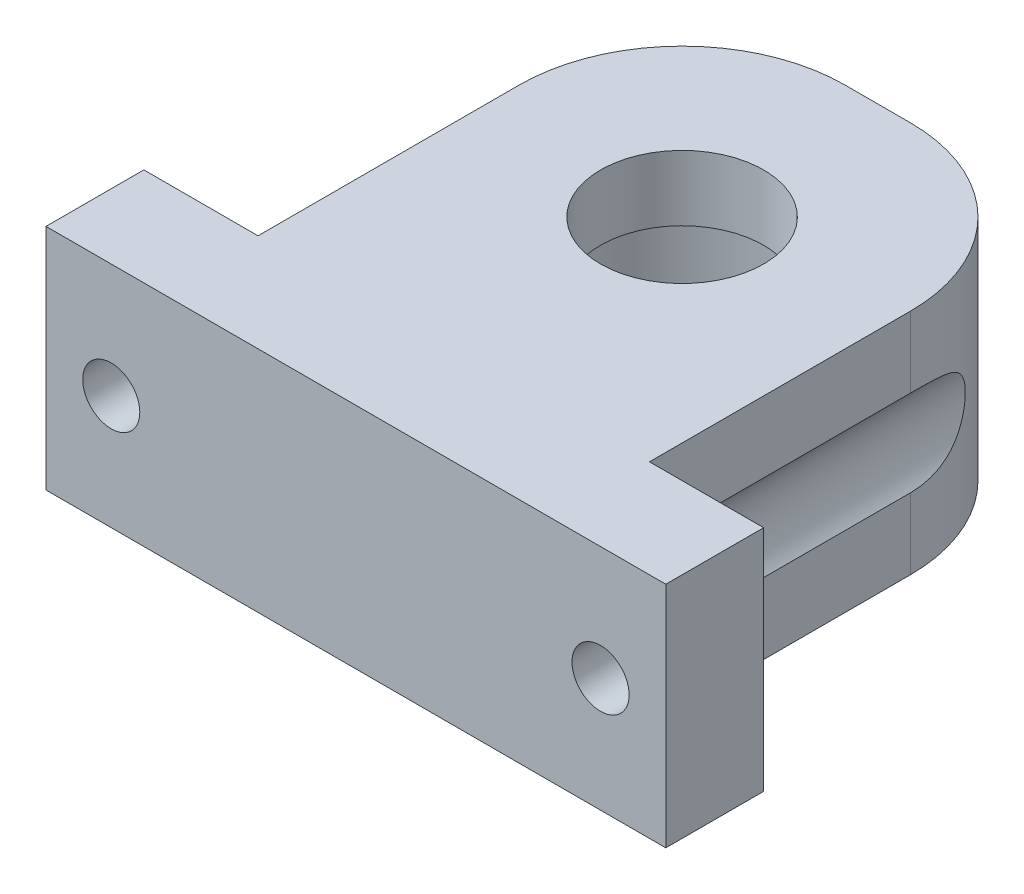
ISO-10303-21;
HEADER;
FILE_DESCRIPTION(('STEP AP214'),'2;1');
FILE_NAME('part.step','',(''),(''),'','','');
FILE_SCHEMA(('AUTOMOTIVE_DESIGN { 1 0 10303 214 1 1 1 1 }'));
ENDSEC;
DATA;
#1=APPLICATION_CONTEXT('core data for automotive mechanical design processes');
#2=APPLICATION_PROTOCOL_DEFINITION('international standard','automotive_design',2000,#1);
#3=PRODUCT_CONTEXT('',#1,'mechanical');
#4=PRODUCT('Part','Part','',(#3));
#5=PRODUCT_RELATED_PRODUCT_CATEGORY('part','',(#4));
#6=PRODUCT_DEFINITION_FORMATION('','',#4);
#7=PRODUCT_DEFINITION_CONTEXT('part definition',#1,'design');
#8=PRODUCT_DEFINITION('design','',#6,#7);
#9=PRODUCT_DEFINITION_SHAPE('','',#8);
#10=(LENGTH_UNIT() NAMED_UNIT(*) SI_UNIT(.MILLI.,.METRE.));
#11=(NAMED_UNIT(*) PLANE_ANGLE_UNIT() SI_UNIT($,.RADIAN.));
#12=(NAMED_UNIT(*) SI_UNIT($,.STERADIAN.) SOLID_ANGLE_UNIT());
#13=UNCERTAINTY_MEASURE_WITH_UNIT(LENGTH_MEASURE(1.E-05),#10,'distance_accuracy_value','');
#14=(GEOMETRIC_REPRESENTATION_CONTEXT(3) GLOBAL_UNCERTAINTY_ASSIGNED_CONTEXT((#13)) GLOBAL_UNIT_ASSIGNED_CONTEXT((#10,
#11,#12)) REPRESENTATION_CONTEXT('',''));
#15=CARTESIAN_POINT('',(0.,0.,0.));
#16=DIRECTION('',(0.,0.,1.));
#17=DIRECTION('',(1.,0.,0.));
#18=AXIS2_PLACEMENT_3D('',#15,#16,#17);
#19=CARTESIAN_POINT('',(12.,-7.,0.));
#20=DIRECTION('',(-1.,0.,0.));
#21=DIRECTION('',(0.,0.,1.));
#22=AXIS2_PLACEMENT_3D('',#19,#20,#21);
#23=PLANE('',#22);
#24=DIRECTION('',(0.,0.,1.));
#25=VECTOR('',#24,1.);
#26=CARTESIAN_POINT('',(12.,-2.64575131106457,-32.001));
#27=LINE('',#26,#25);
#28=CARTESIAN_POINT('',(12.,-2.64575131106456,-22.));
#29=VERTEX_POINT('',#28);
#30=CARTESIAN_POINT('',(12.,-2.64575131106456,-6.00000000000001));
#31=VERTEX_POINT('',#30);
#32=EDGE_CURVE('E57',#29,#31,#27,.T.);
#33=ORIENTED_EDGE('',*,*,#32,.T.);
#34=DIRECTION('',(0.,1.,0.));
#35=VECTOR('',#34,1.);
#36=CARTESIAN_POINT('',(12.,-7.,-6.00000000000001));
#37=LINE('',#36,#35);
#38=CARTESIAN_POINT('',(12.,-7.,-6.00000000000001));
#39=VERTEX_POINT('',#38);
#40=EDGE_CURVE('E169',#39,#31,#37,.T.);
#41=ORIENTED_EDGE('',*,*,#40,.F.);
#42=DIRECTION('',(0.,0.,1.));
#43=VECTOR('',#42,1.);
#44=CARTESIAN_POINT('',(12.,-7.,0.));
#45=LINE('',#44,#43);
#46=CARTESIAN_POINT('',(12.,-7.,-22.));
#47=VERTEX_POINT('',#46);
#48=EDGE_CURVE('E235',#47,#39,#45,.T.);
#49=ORIENTED_EDGE('',*,*,#48,.F.);
#50=DIRECTION('',(0.,1.,0.));
#51=VECTOR('',#50,1.);
#52=CARTESIAN_POINT('',(12.,-7.,-22.));
#53=LINE('',#52,#51);
#54=EDGE_CURVE('E42',#47,#29,#53,.T.);
#55=ORIENTED_EDGE('',*,*,#54,.T.);
#56=EDGE_LOOP('',(#33,#41,#49,#55));
#57=FACE_BOUND('',#56,.T.);
#58=ADVANCED_FACE('F34',(#57),#23,.F.);
#59=DIRECTION('',(0.,0.,1.));
#60=VECTOR('',#59,1.);
#61=CARTESIAN_POINT('',(12.,2.64575131106457,-32.001));
#62=LINE('',#61,#60);
#63=CARTESIAN_POINT('',(12.,2.64575131106456,-6.00000000000001));
#64=VERTEX_POINT('',#63);
#65=CARTESIAN_POINT('',(12.,2.64575131106456,-22.));
#66=VERTEX_POINT('',#65);
#67=EDGE_CURVE('E197',#64,#66,#62,.F.);
#68=ORIENTED_EDGE('',*,*,#67,.T.);
#69=CARTESIAN_POINT('',(12.,7.,-22.));
#70=VERTEX_POINT('',#69);
#71=EDGE_CURVE('E181',#66,#70,#53,.T.);
#72=ORIENTED_EDGE('',*,*,#71,.T.);
#73=DIRECTION('',(0.,0.,1.));
#74=VECTOR('',#73,1.);
#75=CARTESIAN_POINT('',(12.,7.,0.));
#76=LINE('',#75,#74);
#77=CARTESIAN_POINT('',(12.,7.,-6.00000000000001));
#78=VERTEX_POINT('',#77);
#79=EDGE_CURVE('E194',#70,#78,#76,.T.);
#80=ORIENTED_EDGE('',*,*,#79,.T.);
#81=EDGE_CURVE('E254',#64,#78,#37,.T.);
#82=ORIENTED_EDGE('',*,*,#81,.F.);
#83=EDGE_LOOP('',(#68,#72,#80,#82));
#84=FACE_BOUND('',#83,.T.);
#85=ADVANCED_FACE('F191',(#84),#23,.F.);
#86=CARTESIAN_POINT('',(-12.,-7.,0.));
#87=DIRECTION('',(-1.,0.,0.));
#88=DIRECTION('',(0.,0.,1.));
#89=AXIS2_PLACEMENT_3D('',#86,#87,#88);
#90=PLANE('',#89);
#91=DIRECTION('',(0.,1.,0.));
#92=VECTOR('',#91,1.);
#93=CARTESIAN_POINT('',(-12.,-7.,-6.));
#94=LINE('',#93,#92);
#95=CARTESIAN_POINT('',(-12.,-7.,-6.));
#96=VERTEX_POINT('',#95);
#97=CARTESIAN_POINT('',(-12.,-2.64575131106459,-6.));
#98=VERTEX_POINT('',#97);
#99=EDGE_CURVE('E157',#96,#98,#94,.T.);
#100=ORIENTED_EDGE('',*,*,#99,.T.);
#101=DIRECTION('',(0.,0.,1.));
#102=VECTOR('',#101,1.);
#103=CARTESIAN_POINT('',(-12.,-2.64575131106458,-32.001));
#104=LINE('',#103,#102);
#105=CARTESIAN_POINT('',(-12.,-2.64575131106458,-22.));
#106=VERTEX_POINT('',#105);
#107=EDGE_CURVE('E136',#106,#98,#104,.T.);
#108=ORIENTED_EDGE('',*,*,#107,.F.);
#109=DIRECTION('',(0.,1.,0.));
#110=VECTOR('',#109,1.);
#111=CARTESIAN_POINT('',(-12.,-7.,-22.));
#112=LINE('',#111,#110);
#113=CARTESIAN_POINT('',(-12.,-7.,-22.));
#114=VERTEX_POINT('',#113);
#115=EDGE_CURVE('E176',#106,#114,#112,.F.);
#116=ORIENTED_EDGE('',*,*,#115,.T.);
#117=DIRECTION('',(0.,0.,1.));
#118=VECTOR('',#117,1.);
#119=CARTESIAN_POINT('',(-12.,-7.,0.));
#120=LINE('',#119,#118);
#121=EDGE_CURVE('E240',#114,#96,#120,.T.);
#122=ORIENTED_EDGE('',*,*,#121,.T.);
#123=EDGE_LOOP('',(#100,#108,#116,#122));
#124=FACE_BOUND('',#123,.T.);
#125=ADVANCED_FACE('F284',(#124),#90,.T.);
#126=CARTESIAN_POINT('',(-12.,7.,-22.));
#127=VERTEX_POINT('',#126);
#128=CARTESIAN_POINT('',(-12.,2.64575131106458,-22.));
#129=VERTEX_POINT('',#128);
#130=EDGE_CURVE('E150',#127,#129,#112,.F.);
#131=ORIENTED_EDGE('',*,*,#130,.T.);
#132=DIRECTION('',(0.,0.,1.));
#133=VECTOR('',#132,1.);
#134=CARTESIAN_POINT('',(-12.,2.64575131106458,-32.001));
#135=LINE('',#134,#133);
#136=CARTESIAN_POINT('',(-12.,2.64575131106459,-6.));
#137=VERTEX_POINT('',#136);
#138=EDGE_CURVE('E49',#137,#129,#135,.F.);
#139=ORIENTED_EDGE('',*,*,#138,.F.);
#140=CARTESIAN_POINT('',(-12.,7.,-6.));
#141=VERTEX_POINT('',#140);
#142=EDGE_CURVE('E147',#137,#141,#94,.T.);
#143=ORIENTED_EDGE('',*,*,#142,.T.);
#144=DIRECTION('',(0.,0.,1.));
#145=VECTOR('',#144,1.);
#146=CARTESIAN_POINT('',(-12.,7.,0.));
#147=LINE('',#146,#145);
#148=EDGE_CURVE('E212',#127,#141,#147,.T.);
#149=ORIENTED_EDGE('',*,*,#148,.F.);
#150=EDGE_LOOP('',(#131,#139,#143,#149));
#151=FACE_BOUND('',#150,.T.);
#152=ADVANCED_FACE('F145',(#151),#90,.T.);
#153=CARTESIAN_POINT('',(-2.,-7.,-22.));
#154=DIRECTION('',(0.,-1.,0.));
#155=DIRECTION('',(0.,0.,-1.));
#156=AXIS2_PLACEMENT_3D('',#153,#154,#155);
#157=CYLINDRICAL_SURFACE('',#156,10.);
#158=ORIENTED_EDGE('',*,*,#115,.F.);
#159=CARTESIAN_POINT('',(-12.,2.64575131106458,-22.));
#160=CARTESIAN_POINT('',(-12.0000005615978,2.6457473883319,-22.0842319254575));
#161=CARTESIAN_POINT('',(-11.9989354718549,2.64454491931631,-22.1684552438665));
#162=CARTESIAN_POINT('',(-11.9946818569406,2.63971162334975,-22.3367834222242));
#163=CARTESIAN_POINT('',(-11.9914932040722,2.6360806503646,-22.4208882747443));
#164=CARTESIAN_POINT('',(-11.9787423188983,2.62148503392758,-22.6730870249992));
#165=CARTESIAN_POINT('',(-11.9659951938834,2.60681752443941,-22.8408348791284));
#166=CARTESIAN_POINT('',(-11.9320509384214,2.56678460995364,-23.1760348770817));
#167=CARTESIAN_POINT('',(-11.9107640869591,2.54130544481588,-23.3434642861522));
#168=CARTESIAN_POINT('',(-11.8601776051428,2.47853843483869,-23.6747909513551));
#169=CARTESIAN_POINT('',(-11.8308841723973,2.44125972009588,-23.8386908341405));
#170=CARTESIAN_POINT('',(-11.7768575647841,2.36908766047244,-24.1033813044664));
#171=CARTESIAN_POINT('',(-11.7542644495231,2.33814518735697,-24.2056985004944));
#172=CARTESIAN_POINT('',(-11.7063820565965,2.27020114103579,-24.4076774395));
#173=CARTESIAN_POINT('',(-11.681092738977,2.23319947803682,-24.5073391430995));
#174=CARTESIAN_POINT('',(-11.6282901678593,2.15264627027813,-24.7030093952243));
#175=CARTESIAN_POINT('',(-11.6007840997862,2.10911552295765,-24.7990283721703));
#176=CARTESIAN_POINT('',(-11.5440247904219,2.01476066963067,-24.9868417051411));
#177=CARTESIAN_POINT('',(-11.5147721005901,1.96393885859073,-25.0786373785483));
#178=CARTESIAN_POINT('',(-11.4417820691001,1.82956655579243,-25.2971603583279));
#179=CARTESIAN_POINT('',(-11.3974476699028,1.74157668165262,-25.4210288822908));
#180=CARTESIAN_POINT('',(-11.3096003042743,1.54671327970262,-25.6533160472755));
#181=CARTESIAN_POINT('',(-11.2660862525771,1.43986697061784,-25.7617565560757));
#182=CARTESIAN_POINT('',(-11.1942807633615,1.23499118253447,-25.9334035189802));
#183=CARTESIAN_POINT('',(-11.1648713135625,1.1412121539947,-26.0011836965049));
#184=CARTESIAN_POINT('',(-11.1113655280422,0.942890218740153,-26.121572419816));
#185=CARTESIAN_POINT('',(-11.0872667829978,0.838352224786128,-26.1741878487876));
#186=CARTESIAN_POINT('',(-11.0466586175191,0.619341486101825,-26.2614953141108));
#187=CARTESIAN_POINT('',(-11.0302232603118,0.504784003571052,-26.2960128241416));
#188=CARTESIAN_POINT('',(-11.0074164194166,0.270340662257057,-26.3436373251596));
#189=CARTESIAN_POINT('',(-11.0010344082065,0.150460512672634,-26.3567667135537));
#190=CARTESIAN_POINT('',(-10.9993322232774,-0.0719446211524672,-26.3602746834428));
#191=CARTESIAN_POINT('',(-11.0025201100481,-0.174422982813568,-26.3537216497985));
#192=CARTESIAN_POINT('',(-11.0164760205095,-0.376555452808081,-26.3247447151274));
#193=CARTESIAN_POINT('',(-11.0272436483953,-0.476209708330222,-26.3023216428144));
#194=CARTESIAN_POINT('',(-11.0549671076403,-0.667738679699346,-26.2436514318723));
#195=CARTESIAN_POINT('',(-11.0717697115582,-0.759742031957923,-26.2077456717342));
#196=CARTESIAN_POINT('',(-11.1102165728045,-0.93691985365937,-26.1238432979531));
#197=CARTESIAN_POINT('',(-11.1318626840941,-1.02209169118297,-26.0758420536024));
#198=CARTESIAN_POINT('',(-11.1891228971057,-1.22161276556557,-25.9455135093628));
#199=CARTESIAN_POINT('',(-11.2266223160131,-1.33169958829043,-25.8574871275604));
#200=CARTESIAN_POINT('',(-11.3047347400363,-1.5352452781417,-25.6650660080512));
#201=CARTESIAN_POINT('',(-11.3453543083811,-1.6286676408531,-25.560636255838));
#202=CARTESIAN_POINT('',(-11.4155239127641,-1.77659136712311,-25.3697629938766));
#203=CARTESIAN_POINT('',(-11.4450900370555,-1.83477863326383,-25.2861168011818));
#204=CARTESIAN_POINT('',(-11.5033381276926,-1.94349275144435,-25.1136542946336));
#205=CARTESIAN_POINT('',(-11.5320196814738,-1.99401607080516,-25.0248356224847));
#206=CARTESIAN_POINT('',(-11.5878422164036,-2.0881034402604,-24.8429476939087));
#207=CARTESIAN_POINT('',(-11.6149805180693,-2.13165561102577,-24.7498715221511));
#208=CARTESIAN_POINT('',(-11.6671617140935,-2.21235026011973,-24.5604006879273));
#209=CARTESIAN_POINT('',(-11.6922039665159,-2.24949077848842,-24.4640050214973));
#210=CARTESIAN_POINT('',(-11.7515277754635,-2.33480662142627,-24.2204084896574));
#211=CARTESIAN_POINT('',(-11.7842828197374,-2.37940342763876,-24.0715752038181));
#212=CARTESIAN_POINT('',(-11.8433679739777,-2.45724474888853,-23.7696907804574));
#213=CARTESIAN_POINT('',(-11.8696943794445,-2.4904827227909,-23.6166372672972));
#214=CARTESIAN_POINT('',(-11.9153516833702,-2.54681293668421,-23.3077348522886));
#215=CARTESIAN_POINT('',(-11.9346854758877,-2.56990937483918,-23.1518871349826));
#216=CARTESIAN_POINT('',(-11.9660316316968,-2.60684136304549,-22.8384541954586));
#217=CARTESIAN_POINT('',(-11.9780478454424,-2.62068178391946,-22.6808699315198));
#218=CARTESIAN_POINT('',(-11.9908811889881,-2.63538361477387,-22.4357797105688));
#219=CARTESIAN_POINT('',(-11.9943041976517,-2.63928231874081,-22.3485726584566));
#220=CARTESIAN_POINT('',(-11.9988611542094,-2.6444604402722,-22.1742459031861));
#221=CARTESIAN_POINT('',(-12.0000009751624,-2.64574657827779,-22.0871265535684));
#222=CARTESIAN_POINT('',(-12.,-2.64575131106458,-22.));
#223=B_SPLINE_CURVE_WITH_KNOTS('',3,(#159,#160,#161,#162,#163,#164,#165,#166,#167,#168,#169,
#170,#171,#172,#173,#174,#175,#176,#177,#178,#179,#180,#181,#182,#183,#184,#185,#186,#187,#188,
#189,#190,#191,#192,#193,#194,#195,#196,#197,#198,#199,#200,#201,#202,#203,#204,#205,#206,#207,
#208,#209,#210,#211,#212,#213,#214,#215,#216,#217,#218,#219,#220,#221,#222),.UNSPECIFIED.,.F.,
.F.,(4,2,2,2,2,2,2,2,2,2,2,2,2,2,2,2,2,2,2,2,2,2,2,2,2,2,2,2,2,2,2,4),(0.,0.252662935427017,
0.50534106569977,1.01138620378911,1.52289339684541,2.03400576632742,2.3615721709051,
2.68914343024345,3.01569258903285,3.34213918640818,3.81541410884566,4.28801137828487,
4.64485353896311,5.0015334752071,5.36159255028355,5.72127433249133,6.02793568622049,
6.33458102765546,6.63393512116245,6.93340399577205,7.36854318085736,7.80462415962586,
8.12250276607321,8.4405274555854,8.7590884410506,9.07774663474792,9.5534000458433,
10.0293269085423,10.5050565716195,10.9805356926001,11.2425585110728,11.5039064565213),.UNSPECIFIED.);
#224=EDGE_CURVE('E141',#129,#106,#223,.T.);
#225=ORIENTED_EDGE('',*,*,#224,.F.);
#226=ORIENTED_EDGE('',*,*,#130,.F.);
#227=CARTESIAN_POINT('',(-2.,7.,-22.));
#228=DIRECTION('',(0.,1.,0.));
#229=DIRECTION('',(0.,0.,1.));
#230=AXIS2_PLACEMENT_3D('',#227,#228,#229);
#231=CIRCLE('',#230,10.);
#232=CARTESIAN_POINT('',(-2.,7.,-32.));
#233=VERTEX_POINT('',#232);
#234=EDGE_CURVE('E174',#233,#127,#231,.T.);
#235=ORIENTED_EDGE('',*,*,#234,.F.);
#236=DIRECTION('',(0.,1.,0.));
#237=VECTOR('',#236,1.);
#238=CARTESIAN_POINT('',(-2.,7.,-32.));
#239=LINE('',#238,#237);
#240=CARTESIAN_POINT('',(-2.,-7.,-32.));
#241=VERTEX_POINT('',#240);
#242=EDGE_CURVE('E168',#241,#233,#239,.T.);
#243=ORIENTED_EDGE('',*,*,#242,.F.);
#244=CARTESIAN_POINT('',(-2.,-7.,-22.));
#245=DIRECTION('',(0.,1.,0.));
#246=DIRECTION('',(0.,0.,1.));
#247=AXIS2_PLACEMENT_3D('',#244,#245,#246);
#248=CIRCLE('',#247,10.);
#249=EDGE_CURVE('E180',#114,#241,#248,.F.);
#250=ORIENTED_EDGE('',*,*,#249,.F.);
#251=EDGE_LOOP('',(#158,#225,#226,#235,#243,#250));
#252=FACE_BOUND('',#251,.T.);
#253=ADVANCED_FACE('F292',(#252),#157,.T.);
#254=CARTESIAN_POINT('',(2.,-7.,-22.));
#255=DIRECTION('',(0.,1.,0.));
#256=DIRECTION('',(0.,0.,1.));
#257=AXIS2_PLACEMENT_3D('',#254,#255,#256);
#258=CYLINDRICAL_SURFACE('',#257,10.);
#259=ORIENTED_EDGE('',*,*,#71,.F.);
#260=CARTESIAN_POINT('',(12.,-2.64575131106456,-22.));
#261=CARTESIAN_POINT('',(12.0000005615978,-2.64574738833188,-22.0842319254575));
#262=CARTESIAN_POINT('',(11.9989354718549,-2.64454491931629,-22.1684552438665));
#263=CARTESIAN_POINT('',(11.9946818569406,-2.63971162334974,-22.3367834222242));
#264=CARTESIAN_POINT('',(11.9914932040722,-2.63608065036458,-22.4208882747443));
#265=CARTESIAN_POINT('',(11.9787423188983,-2.62148503392757,-22.6730870249992));
#266=CARTESIAN_POINT('',(11.9659951938834,-2.6068175244394,-22.8408348791284));
#267=CARTESIAN_POINT('',(11.9320509384214,-2.56678460995362,-23.1760348770817));
#268=CARTESIAN_POINT('',(11.9107640869591,-2.54130544481586,-23.3434642861522));
#269=CARTESIAN_POINT('',(11.8601776051428,-2.47853843483866,-23.6747909513551));
#270=CARTESIAN_POINT('',(11.8308841723973,-2.44125972009586,-23.8386908341405));
#271=CARTESIAN_POINT('',(11.7768575647841,-2.36908766047242,-24.1033813044664));
#272=CARTESIAN_POINT('',(11.7542644495231,-2.33814518735694,-24.2056985004944));
#273=CARTESIAN_POINT('',(11.7063820565965,-2.27020114103576,-24.4076774395));
#274=CARTESIAN_POINT('',(11.681092738977,-2.23319947803681,-24.5073391430995));
#275=CARTESIAN_POINT('',(11.6282901678593,-2.15264627027812,-24.7030093952243));
#276=CARTESIAN_POINT('',(11.6007840997862,-2.10911552295763,-24.7990283721703));
#277=CARTESIAN_POINT('',(11.5440247904219,-2.01476066963065,-24.9868417051411));
#278=CARTESIAN_POINT('',(11.5147721005901,-1.96393885859071,-25.0786373785483));
#279=CARTESIAN_POINT('',(11.4417820691001,-1.82956655579241,-25.2971603583279));
#280=CARTESIAN_POINT('',(11.3974476699028,-1.7415766816526,-25.4210288822908));
#281=CARTESIAN_POINT('',(11.3096003042743,-1.5467132797026,-25.6533160472755));
#282=CARTESIAN_POINT('',(11.2660862525771,-1.43986697061782,-25.7617565560757));
#283=CARTESIAN_POINT('',(11.1942807633615,-1.23499118253445,-25.9334035189802));
#284=CARTESIAN_POINT('',(11.1648713135625,-1.14121215399468,-26.0011836965048));
#285=CARTESIAN_POINT('',(11.1113655280422,-0.942890218740136,-26.121572419816));
#286=CARTESIAN_POINT('',(11.0872667829978,-0.838352224786113,-26.1741878487876));
#287=CARTESIAN_POINT('',(11.0466586175191,-0.619341486101814,-26.2614953141108));
#288=CARTESIAN_POINT('',(11.0302232603118,-0.504784003571041,-26.2960128241416));
#289=CARTESIAN_POINT('',(11.0074164194167,-0.270340662257047,-26.3436373251596));
#290=CARTESIAN_POINT('',(11.0010344082065,-0.150460512672625,-26.3567667135536));
#291=CARTESIAN_POINT('',(10.9993322232774,0.0719446211524748,-26.3602746834427));
#292=CARTESIAN_POINT('',(11.0025201100481,0.174422982813574,-26.3537216497984));
#293=CARTESIAN_POINT('',(11.0164760205095,0.376555452808084,-26.3247447151274));
#294=CARTESIAN_POINT('',(11.0272436483953,0.476209708330224,-26.3023216428144));
#295=CARTESIAN_POINT('',(11.0549671076403,0.667738679699344,-26.2436514318722));
#296=CARTESIAN_POINT('',(11.0717697115582,0.759742031957918,-26.2077456717342));
#297=CARTESIAN_POINT('',(11.1102165728045,0.936919853659363,-26.1238432979531));
#298=CARTESIAN_POINT('',(11.1318626840941,1.02209169118297,-26.0758420536024));
#299=CARTESIAN_POINT('',(11.1891228971058,1.22161276556556,-25.9455135093628));
#300=CARTESIAN_POINT('',(11.2266223160131,1.33169958829042,-25.8574871275604));
#301=CARTESIAN_POINT('',(11.3047347400363,1.53524527814169,-25.6650660080511));
#302=CARTESIAN_POINT('',(11.3453543083811,1.62866764085309,-25.560636255838));
#303=CARTESIAN_POINT('',(11.4155239127641,1.7765913671231,-25.3697629938766));
#304=CARTESIAN_POINT('',(11.4450900370555,1.83477863326382,-25.2861168011818));
#305=CARTESIAN_POINT('',(11.5033381276926,1.94349275144434,-25.1136542946336));
#306=CARTESIAN_POINT('',(11.5320196814738,1.99401607080515,-25.0248356224847));
#307=CARTESIAN_POINT('',(11.5878422164036,2.08810344026038,-24.8429476939087));
#308=CARTESIAN_POINT('',(11.6149805180693,2.13165561102576,-24.7498715221511));
#309=CARTESIAN_POINT('',(11.6671617140935,2.21235026011972,-24.5604006879273));
#310=CARTESIAN_POINT('',(11.6922039665159,2.24949077848841,-24.4640050214973));
#311=CARTESIAN_POINT('',(11.7515277754635,2.33480662142625,-24.2204084896574));
#312=CARTESIAN_POINT('',(11.7842828197374,2.37940342763874,-24.0715752038181));
#313=CARTESIAN_POINT('',(11.8433679739777,2.45724474888851,-23.7696907804574));
#314=CARTESIAN_POINT('',(11.8696943794445,2.49048272279089,-23.6166372672972));
#315=CARTESIAN_POINT('',(11.9153516833702,2.54681293668419,-23.3077348522886));
#316=CARTESIAN_POINT('',(11.9346854758877,2.56990937483916,-23.1518871349826));
#317=CARTESIAN_POINT('',(11.9660316316968,2.60684136304547,-22.8384541954585));
#318=CARTESIAN_POINT('',(11.9780478454424,2.62068178391944,-22.6808699315198));
#319=CARTESIAN_POINT('',(11.9908811889881,2.63538361477385,-22.4357797105688));
#320=CARTESIAN_POINT('',(11.9943041976517,2.63928231874079,-22.3485726584566));
#321=CARTESIAN_POINT('',(11.9988611542094,2.64446044027218,-22.1742459031861));
#322=CARTESIAN_POINT('',(12.0000009751624,2.64574657827777,-22.0871265535684));
#323=CARTESIAN_POINT('',(12.,2.64575131106456,-22.));
#324=B_SPLINE_CURVE_WITH_KNOTS('',3,(#260,#261,#262,#263,#264,#265,#266,#267,#268,#269,#270,
#271,#272,#273,#274,#275,#276,#277,#278,#279,#280,#281,#282,#283,#284,#285,#286,#287,#288,#289,
#290,#291,#292,#293,#294,#295,#296,#297,#298,#299,#300,#301,#302,#303,#304,#305,#306,#307,#308,
#309,#310,#311,#312,#313,#314,#315,#316,#317,#318,#319,#320,#321,#322,#323),.UNSPECIFIED.,.F.,
.F.,(4,2,2,2,2,2,2,2,2,2,2,2,2,2,2,2,2,2,2,2,2,2,2,2,2,2,2,2,2,2,2,4),(0.,0.25266293542702,
0.505341065699773,1.01138620378911,1.52289339684541,2.03400576632741,2.3615721709051,
2.68914343024344,3.01569258903285,3.34213918640817,3.81541410884565,4.28801137828485,
4.64485353896309,5.00153347520707,5.36159255028352,5.7212743324913,6.02793568622046,
6.33458102765542,6.63393512116241,6.933403995772,7.36854318085731,7.80462415962581,
8.12250276607316,8.44052745558536,8.75908844105054,9.07774663474787,9.55340004584325,
10.0293269085423,10.5050565716195,10.9805356926,11.2425585110727,11.5039064565212),.UNSPECIFIED.);
#325=EDGE_CURVE('E151',#29,#66,#324,.T.);
#326=ORIENTED_EDGE('',*,*,#325,.F.);
#327=ORIENTED_EDGE('',*,*,#54,.F.);
#328=CARTESIAN_POINT('',(2.,-7.,-22.));
#329=DIRECTION('',(0.,1.,0.));
#330=DIRECTION('',(0.,0.,1.));
#331=AXIS2_PLACEMENT_3D('',#328,#329,#330);
#332=CIRCLE('',#331,10.);
#333=CARTESIAN_POINT('',(2.,-7.,-32.));
#334=VERTEX_POINT('',#333);
#335=EDGE_CURVE('E178',#334,#47,#332,.F.);
#336=ORIENTED_EDGE('',*,*,#335,.F.);
#337=DIRECTION('',(0.,1.,0.));
#338=VECTOR('',#337,1.);
#339=CARTESIAN_POINT('',(2.,-7.,-32.));
#340=LINE('',#339,#338);
#341=CARTESIAN_POINT('',(2.,7.,-32.));
#342=VERTEX_POINT('',#341);
#343=EDGE_CURVE('E166',#342,#334,#340,.F.);
#344=ORIENTED_EDGE('',*,*,#343,.F.);
#345=CARTESIAN_POINT('',(2.,7.,-22.));
#346=DIRECTION('',(0.,1.,0.));
#347=DIRECTION('',(0.,0.,1.));
#348=AXIS2_PLACEMENT_3D('',#345,#346,#347);
#349=CIRCLE('',#348,10.);
#350=EDGE_CURVE('E172',#70,#342,#349,.T.);
#351=ORIENTED_EDGE('',*,*,#350,.F.);
#352=EDGE_LOOP('',(#259,#326,#327,#336,#344,#351));
#353=FACE_BOUND('',#352,.T.);
#354=ADVANCED_FACE('F36',(#353),#258,.T.);
#355=CARTESIAN_POINT('',(0.,-7.,-20.));
#356=DIRECTION('',(0.,1.,0.));
#357=DIRECTION('',(0.,0.,1.));
#358=AXIS2_PLACEMENT_3D('',#355,#356,#357);
#359=CYLINDRICAL_SURFACE('',#358,8.15);
#360=CARTESIAN_POINT('',(0.,-7.,-20.));
#361=DIRECTION('',(0.,1.,0.));
#362=DIRECTION('',(0.,0.,1.));
#363=AXIS2_PLACEMENT_3D('',#360,#361,#362);
#364=CIRCLE('',#363,8.15);
#365=CARTESIAN_POINT('',(0.,-7.,-11.85));
#366=VERTEX_POINT('',#365);
#367=EDGE_CURVE('E232',#366,#366,#364,.T.);
#368=ORIENTED_EDGE('',*,*,#367,.F.);
#369=EDGE_LOOP('',(#368));
#370=FACE_BOUND('',#369,.T.);
#371=CARTESIAN_POINT('',(0.,3.,-20.));
#372=DIRECTION('',(0.,1.,0.));
#373=DIRECTION('',(0.,0.,1.));
#374=AXIS2_PLACEMENT_3D('',#371,#372,#373);
#375=CIRCLE('',#374,8.15);
#376=CARTESIAN_POINT('',(0.,3.,-11.85));
#377=VERTEX_POINT('',#376);
#378=EDGE_CURVE('E11',#377,#377,#375,.F.);
#379=ORIENTED_EDGE('',*,*,#378,.F.);
#380=EDGE_LOOP('',(#379));
#381=FACE_BOUND('',#380,.T.);
#382=ADVANCED_FACE('F288',(#370,#381),#359,.F.);
#383=CARTESIAN_POINT('',(0.,-7.,-6.00000000000001));
#384=DIRECTION('',(0.,0.,1.));
#385=DIRECTION('',(1.,0.,0.));
#386=AXIS2_PLACEMENT_3D('',#383,#384,#385);
#387=PLANE('',#386);
#388=CARTESIAN_POINT('',(15.,0.,-6.));
#389=DIRECTION('',(0.,0.,1.));
#390=DIRECTION('',(1.,0.,0.));
#391=AXIS2_PLACEMENT_3D('',#388,#389,#390);
#392=CIRCLE('',#391,1.75);
#393=CARTESIAN_POINT('',(16.75,0.,-6.));
#394=VERTEX_POINT('',#393);
#395=EDGE_CURVE('E218',#394,#394,#392,.F.);
#396=ORIENTED_EDGE('',*,*,#395,.F.);
#397=EDGE_LOOP('',(#396));
#398=FACE_BOUND('',#397,.T.);
#399=ORIENTED_EDGE('',*,*,#40,.T.);
#400=CARTESIAN_POINT('',(15.,0.,-6.00000000000001));
#401=DIRECTION('',(0.,0.,-1.));
#402=DIRECTION('',(1.,0.,0.));
#403=AXIS2_PLACEMENT_3D('',#400,#401,#402);
#404=CIRCLE('',#403,3.99999999999999);
#405=EDGE_CURVE('E315',#31,#64,#404,.T.);
#406=ORIENTED_EDGE('',*,*,#405,.T.);
#407=ORIENTED_EDGE('',*,*,#81,.T.);
#408=DIRECTION('',(1.,0.,0.));
#409=VECTOR('',#408,1.);
#410=CARTESIAN_POINT('',(0.,7.,-6.00000000000001));
#411=LINE('',#410,#409);
#412=CARTESIAN_POINT('',(19.,7.,-6.));
#413=VERTEX_POINT('',#412);
#414=EDGE_CURVE('E208',#78,#413,#411,.T.);
#415=ORIENTED_EDGE('',*,*,#414,.T.);
#416=DIRECTION('',(0.,1.,0.));
#417=VECTOR('',#416,1.);
#418=CARTESIAN_POINT('',(19.,-7.,-6.));
#419=LINE('',#418,#417);
#420=CARTESIAN_POINT('',(19.,-7.,-6.));
#421=VERTEX_POINT('',#420);
#422=EDGE_CURVE('E255',#421,#413,#419,.T.);
#423=ORIENTED_EDGE('',*,*,#422,.F.);
#424=DIRECTION('',(1.,0.,0.));
#425=VECTOR('',#424,1.);
#426=CARTESIAN_POINT('',(0.,-7.,-6.00000000000001));
#427=LINE('',#426,#425);
#428=EDGE_CURVE('E158',#39,#421,#427,.T.);
#429=ORIENTED_EDGE('',*,*,#428,.F.);
#430=EDGE_LOOP('',(#399,#406,#407,#415,#423,#429));
#431=FACE_BOUND('',#430,.T.);
#432=ADVANCED_FACE('F290',(#398,#431),#387,.F.);
#433=CARTESIAN_POINT('',(19.,-7.,0.));
#434=DIRECTION('',(1.,0.,0.));
#435=DIRECTION('',(0.,0.,-1.));
#436=AXIS2_PLACEMENT_3D('',#433,#434,#435);
#437=PLANE('',#436);
#438=ORIENTED_EDGE('',*,*,#422,.T.);
#439=DIRECTION('',(0.,0.,-1.));
#440=VECTOR('',#439,1.);
#441=CARTESIAN_POINT('',(19.,7.,0.));
#442=LINE('',#441,#440);
#443=CARTESIAN_POINT('',(19.,7.,0.));
#444=VERTEX_POINT('',#443);
#445=EDGE_CURVE('E229',#444,#413,#442,.T.);
#446=ORIENTED_EDGE('',*,*,#445,.F.);
#447=DIRECTION('',(0.,1.,0.));
#448=VECTOR('',#447,1.);
#449=CARTESIAN_POINT('',(19.,-7.,0.));
#450=LINE('',#449,#448);
#451=CARTESIAN_POINT('',(19.,-7.,0.));
#452=VERTEX_POINT('',#451);
#453=EDGE_CURVE('E257',#452,#444,#450,.T.);
#454=ORIENTED_EDGE('',*,*,#453,.F.);
#455=DIRECTION('',(0.,0.,-1.));
#456=VECTOR('',#455,1.);
#457=CARTESIAN_POINT('',(19.,-7.,0.));
#458=LINE('',#457,#456);
#459=EDGE_CURVE('E161',#452,#421,#458,.T.);
#460=ORIENTED_EDGE('',*,*,#459,.T.);
#461=EDGE_LOOP('',(#438,#446,#454,#460));
#462=FACE_BOUND('',#461,.T.);
#463=ADVANCED_FACE('F276',(#462),#437,.T.);
#464=CARTESIAN_POINT('',(0.,-7.,0.));
#465=DIRECTION('',(0.,0.,1.));
#466=DIRECTION('',(1.,0.,0.));
#467=AXIS2_PLACEMENT_3D('',#464,#465,#466);
#468=PLANE('',#467);
#469=CARTESIAN_POINT('',(-15.,0.,0.));
#470=DIRECTION('',(0.,0.,1.));
#471=DIRECTION('',(1.,0.,0.));
#472=AXIS2_PLACEMENT_3D('',#469,#470,#471);
#473=CIRCLE('',#472,1.75);
#474=CARTESIAN_POINT('',(-13.25,0.,0.));
#475=VERTEX_POINT('',#474);
#476=EDGE_CURVE('E210',#475,#475,#473,.T.);
#477=ORIENTED_EDGE('',*,*,#476,.F.);
#478=EDGE_LOOP('',(#477));
#479=FACE_BOUND('',#478,.T.);
#480=CARTESIAN_POINT('',(15.,0.,0.));
#481=DIRECTION('',(0.,0.,1.));
#482=DIRECTION('',(-1.,0.,0.));
#483=AXIS2_PLACEMENT_3D('',#480,#481,#482);
#484=CIRCLE('',#483,1.75);
#485=CARTESIAN_POINT('',(13.25,0.,0.));
#486=VERTEX_POINT('',#485);
#487=EDGE_CURVE('E513',#486,#486,#484,.T.);
#488=ORIENTED_EDGE('',*,*,#487,.F.);
#489=EDGE_LOOP('',(#488));
#490=FACE_BOUND('',#489,.T.);
#491=ORIENTED_EDGE('',*,*,#453,.T.);
#492=DIRECTION('',(1.,0.,0.));
#493=VECTOR('',#492,1.);
#494=CARTESIAN_POINT('',(0.,7.,0.));
#495=LINE('',#494,#493);
#496=CARTESIAN_POINT('',(-19.,7.,0.));
#497=VERTEX_POINT('',#496);
#498=EDGE_CURVE('E226',#497,#444,#495,.T.);
#499=ORIENTED_EDGE('',*,*,#498,.F.);
#500=DIRECTION('',(0.,1.,0.));
#501=VECTOR('',#500,1.);
#502=CARTESIAN_POINT('',(-19.,-7.,0.));
#503=LINE('',#502,#501);
#504=CARTESIAN_POINT('',(-19.,-7.,0.));
#505=VERTEX_POINT('',#504);
#506=EDGE_CURVE('E258',#505,#497,#503,.T.);
#507=ORIENTED_EDGE('',*,*,#506,.F.);
#508=DIRECTION('',(1.,0.,0.));
#509=VECTOR('',#508,1.);
#510=CARTESIAN_POINT('',(0.,-7.,0.));
#511=LINE('',#510,#509);
#512=EDGE_CURVE('E247',#505,#452,#511,.T.);
#513=ORIENTED_EDGE('',*,*,#512,.T.);
#514=EDGE_LOOP('',(#491,#499,#507,#513));
#515=FACE_BOUND('',#514,.T.);
#516=ADVANCED_FACE('F267',(#479,#490,#515),#468,.T.);
#517=CARTESIAN_POINT('',(-19.,-7.,0.));
#518=DIRECTION('',(1.,0.,0.));
#519=DIRECTION('',(0.,0.,-1.));
#520=AXIS2_PLACEMENT_3D('',#517,#518,#519);
#521=PLANE('',#520);
#522=ORIENTED_EDGE('',*,*,#506,.T.);
#523=DIRECTION('',(0.,0.,-1.));
#524=VECTOR('',#523,1.);
#525=CARTESIAN_POINT('',(-19.,7.,0.));
#526=LINE('',#525,#524);
#527=CARTESIAN_POINT('',(-19.,7.,-6.));
#528=VERTEX_POINT('',#527);
#529=EDGE_CURVE('E223',#497,#528,#526,.T.);
#530=ORIENTED_EDGE('',*,*,#529,.T.);
#531=DIRECTION('',(0.,1.,0.));
#532=VECTOR('',#531,1.);
#533=CARTESIAN_POINT('',(-19.,-7.,-6.));
#534=LINE('',#533,#532);
#535=CARTESIAN_POINT('',(-19.,-7.,-6.));
#536=VERTEX_POINT('',#535);
#537=EDGE_CURVE('E160',#536,#528,#534,.T.);
#538=ORIENTED_EDGE('',*,*,#537,.F.);
#539=DIRECTION('',(0.,0.,-1.));
#540=VECTOR('',#539,1.);
#541=CARTESIAN_POINT('',(-19.,-7.,0.));
#542=LINE('',#541,#540);
#543=EDGE_CURVE('E245',#505,#536,#542,.T.);
#544=ORIENTED_EDGE('',*,*,#543,.F.);
#545=EDGE_LOOP('',(#522,#530,#538,#544));
#546=FACE_BOUND('',#545,.T.);
#547=ADVANCED_FACE('F265',(#546),#521,.F.);
#548=CARTESIAN_POINT('',(0.,-7.,-6.00000000000001));
#549=DIRECTION('',(0.,0.,-1.));
#550=DIRECTION('',(-1.,0.,0.));
#551=AXIS2_PLACEMENT_3D('',#548,#549,#550);
#552=PLANE('',#551);
#553=CARTESIAN_POINT('',(-15.,0.,-6.));
#554=DIRECTION('',(0.,0.,-1.));
#555=DIRECTION('',(-1.,0.,0.));
#556=AXIS2_PLACEMENT_3D('',#553,#554,#555);
#557=CIRCLE('',#556,1.75);
#558=CARTESIAN_POINT('',(-16.75,0.,-6.));
#559=VERTEX_POINT('',#558);
#560=EDGE_CURVE('E215',#559,#559,#557,.F.);
#561=ORIENTED_EDGE('',*,*,#560,.T.);
#562=EDGE_LOOP('',(#561));
#563=FACE_BOUND('',#562,.T.);
#564=ORIENTED_EDGE('',*,*,#537,.T.);
#565=DIRECTION('',(-1.,0.,0.));
#566=VECTOR('',#565,1.);
#567=CARTESIAN_POINT('',(0.,7.,-6.00000000000001));
#568=LINE('',#567,#566);
#569=EDGE_CURVE('E156',#141,#528,#568,.T.);
#570=ORIENTED_EDGE('',*,*,#569,.F.);
#571=ORIENTED_EDGE('',*,*,#142,.F.);
#572=CARTESIAN_POINT('',(-15.,0.,-6.));
#573=DIRECTION('',(0.,0.,-1.));
#574=DIRECTION('',(-1.,0.,0.));
#575=AXIS2_PLACEMENT_3D('',#572,#573,#574);
#576=CIRCLE('',#575,4.);
#577=EDGE_CURVE('E133',#137,#98,#576,.T.);
#578=ORIENTED_EDGE('',*,*,#577,.T.);
#579=ORIENTED_EDGE('',*,*,#99,.F.);
#580=DIRECTION('',(-1.,0.,0.));
#581=VECTOR('',#580,1.);
#582=CARTESIAN_POINT('',(0.,-7.,-6.00000000000001));
#583=LINE('',#582,#581);
#584=EDGE_CURVE('E242',#96,#536,#583,.T.);
#585=ORIENTED_EDGE('',*,*,#584,.T.);
#586=EDGE_LOOP('',(#564,#570,#571,#578,#579,#585));
#587=FACE_BOUND('',#586,.T.);
#588=ADVANCED_FACE('F154',(#563,#587),#552,.T.);
#589=CARTESIAN_POINT('',(0.,-7.,-32.));
#590=DIRECTION('',(0.,0.,1.));
#591=DIRECTION('',(1.,0.,0.));
#592=AXIS2_PLACEMENT_3D('',#589,#590,#591);
#593=PLANE('',#592);
#594=DIRECTION('',(1.,0.,0.));
#595=VECTOR('',#594,1.);
#596=CARTESIAN_POINT('',(0.,-7.,-32.));
#597=LINE('',#596,#595);
#598=EDGE_CURVE('E237',#241,#334,#597,.T.);
#599=ORIENTED_EDGE('',*,*,#598,.F.);
#600=ORIENTED_EDGE('',*,*,#242,.T.);
#601=DIRECTION('',(1.,0.,0.));
#602=VECTOR('',#601,1.);
#603=CARTESIAN_POINT('',(0.,7.,-32.));
#604=LINE('',#603,#602);
#605=EDGE_CURVE('E209',#233,#342,#604,.T.);
#606=ORIENTED_EDGE('',*,*,#605,.T.);
#607=ORIENTED_EDGE('',*,*,#343,.T.);
#608=EDGE_LOOP('',(#599,#600,#606,#607));
#609=FACE_BOUND('',#608,.T.);
#610=ADVANCED_FACE('F273',(#609),#593,.F.);
#611=CARTESIAN_POINT('',(0.,-7.,0.));
#612=DIRECTION('',(0.,1.,0.));
#613=DIRECTION('',(0.,0.,1.));
#614=AXIS2_PLACEMENT_3D('',#611,#612,#613);
#615=PLANE('',#614);
#616=ORIENTED_EDGE('',*,*,#367,.T.);
#617=EDGE_LOOP('',(#616));
#618=FACE_BOUND('',#617,.T.);
#619=ORIENTED_EDGE('',*,*,#121,.F.);
#620=ORIENTED_EDGE('',*,*,#249,.T.);
#621=ORIENTED_EDGE('',*,*,#598,.T.);
#622=ORIENTED_EDGE('',*,*,#335,.T.);
#623=ORIENTED_EDGE('',*,*,#48,.T.);
#624=ORIENTED_EDGE('',*,*,#428,.T.);
#625=ORIENTED_EDGE('',*,*,#459,.F.);
#626=ORIENTED_EDGE('',*,*,#512,.F.);
#627=ORIENTED_EDGE('',*,*,#543,.T.);
#628=ORIENTED_EDGE('',*,*,#584,.F.);
#629=EDGE_LOOP('',(#619,#620,#621,#622,#623,#624,#625,#626,#627,#628));
#630=FACE_BOUND('',#629,.T.);
#631=ADVANCED_FACE('F305',(#618,#630),#615,.F.);
#632=CARTESIAN_POINT('',(0.,7.,0.));
#633=DIRECTION('',(0.,1.,0.));
#634=DIRECTION('',(0.,0.,1.));
#635=AXIS2_PLACEMENT_3D('',#632,#633,#634);
#636=PLANE('',#635);
#637=ORIENTED_EDGE('',*,*,#605,.F.);
#638=ORIENTED_EDGE('',*,*,#234,.T.);
#639=ORIENTED_EDGE('',*,*,#148,.T.);
#640=ORIENTED_EDGE('',*,*,#569,.T.);
#641=ORIENTED_EDGE('',*,*,#529,.F.);
#642=ORIENTED_EDGE('',*,*,#498,.T.);
#643=ORIENTED_EDGE('',*,*,#445,.T.);
#644=ORIENTED_EDGE('',*,*,#414,.F.);
#645=ORIENTED_EDGE('',*,*,#79,.F.);
#646=ORIENTED_EDGE('',*,*,#350,.T.);
#647=EDGE_LOOP('',(#637,#638,#639,#640,#641,#642,#643,#644,#645,#646));
#648=FACE_BOUND('',#647,.T.);
#649=CARTESIAN_POINT('',(0.,7.,-20.));
#650=DIRECTION('',(0.,1.,0.));
#651=DIRECTION('',(0.,0.,1.));
#652=AXIS2_PLACEMENT_3D('',#649,#650,#651);
#653=CIRCLE('',#652,5.);
#654=CARTESIAN_POINT('',(0.,7.,-15.));
#655=VERTEX_POINT('',#654);
#656=EDGE_CURVE('E519',#655,#655,#653,.T.);
#657=ORIENTED_EDGE('',*,*,#656,.F.);
#658=EDGE_LOOP('',(#657));
#659=FACE_BOUND('',#658,.T.);
#660=ADVANCED_FACE('F204',(#648,#659),#636,.T.);
#661=CARTESIAN_POINT('',(-15.,0.,-32.001));
#662=DIRECTION('',(0.,0.,1.));
#663=DIRECTION('',(1.,0.,0.));
#664=AXIS2_PLACEMENT_3D('',#661,#662,#663);
#665=CYLINDRICAL_SURFACE('',#664,1.75);
#666=ORIENTED_EDGE('',*,*,#560,.F.);
#667=EDGE_LOOP('',(#666));
#668=FACE_BOUND('',#667,.T.);
#669=ORIENTED_EDGE('',*,*,#476,.T.);
#670=EDGE_LOOP('',(#669));
#671=FACE_BOUND('',#670,.T.);
#672=ADVANCED_FACE('F362',(#668,#671),#665,.F.);
#673=CARTESIAN_POINT('',(15.,0.,-32.001));
#674=DIRECTION('',(0.,0.,1.));
#675=DIRECTION('',(1.,0.,0.));
#676=AXIS2_PLACEMENT_3D('',#673,#674,#675);
#677=CYLINDRICAL_SURFACE('',#676,1.75);
#678=ORIENTED_EDGE('',*,*,#487,.T.);
#679=EDGE_LOOP('',(#678));
#680=FACE_BOUND('',#679,.T.);
#681=ORIENTED_EDGE('',*,*,#395,.T.);
#682=EDGE_LOOP('',(#681));
#683=FACE_BOUND('',#682,.T.);
#684=ADVANCED_FACE('F356',(#680,#683),#677,.F.);
#685=CARTESIAN_POINT('',(0.,3.,-20.));
#686=DIRECTION('',(0.,1.,0.));
#687=DIRECTION('',(0.,0.,1.));
#688=AXIS2_PLACEMENT_3D('',#685,#686,#687);
#689=PLANE('',#688);
#690=CARTESIAN_POINT('',(0.,3.,-20.));
#691=DIRECTION('',(0.,1.,0.));
#692=DIRECTION('',(0.,0.,1.));
#693=AXIS2_PLACEMENT_3D('',#690,#691,#692);
#694=CIRCLE('',#693,5.);
#695=CARTESIAN_POINT('',(0.,3.,-15.));
#696=VERTEX_POINT('',#695);
#697=EDGE_CURVE('E336',#696,#696,#694,.T.);
#698=ORIENTED_EDGE('',*,*,#697,.T.);
#699=EDGE_LOOP('',(#698));
#700=FACE_BOUND('',#699,.T.);
#701=ORIENTED_EDGE('',*,*,#378,.T.);
#702=EDGE_LOOP('',(#701));
#703=FACE_BOUND('',#702,.T.);
#704=ADVANCED_FACE('F351',(#700,#703),#689,.F.);
#705=CARTESIAN_POINT('',(0.,3.,-20.));
#706=DIRECTION('',(0.,1.,0.));
#707=DIRECTION('',(0.,0.,1.));
#708=AXIS2_PLACEMENT_3D('',#705,#706,#707);
#709=CYLINDRICAL_SURFACE('',#708,5.);
#710=ORIENTED_EDGE('',*,*,#697,.F.);
#711=EDGE_LOOP('',(#710));
#712=FACE_BOUND('',#711,.T.);
#713=ORIENTED_EDGE('',*,*,#656,.T.);
#714=EDGE_LOOP('',(#713));
#715=FACE_BOUND('',#714,.T.);
#716=ADVANCED_FACE('F347',(#712,#715),#709,.F.);
#717=CARTESIAN_POINT('',(15.,0.,-32.001));
#718=DIRECTION('',(0.,0.,1.));
#719=DIRECTION('',(1.,0.,0.));
#720=AXIS2_PLACEMENT_3D('',#717,#718,#719);
#721=CYLINDRICAL_SURFACE('',#720,3.99999999999999);
#722=ORIENTED_EDGE('',*,*,#325,.T.);
#723=ORIENTED_EDGE('',*,*,#67,.F.);
#724=ORIENTED_EDGE('',*,*,#405,.F.);
#725=ORIENTED_EDGE('',*,*,#32,.F.);
#726=EDGE_LOOP('',(#722,#723,#724,#725));
#727=FACE_BOUND('',#726,.T.);
#728=ADVANCED_FACE('F318',(#727),#721,.F.);
#729=CARTESIAN_POINT('',(-15.,0.,-32.001));
#730=DIRECTION('',(0.,0.,1.));
#731=DIRECTION('',(1.,0.,0.));
#732=AXIS2_PLACEMENT_3D('',#729,#730,#731);
#733=CYLINDRICAL_SURFACE('',#732,4.);
#734=ORIENTED_EDGE('',*,*,#107,.T.);
#735=ORIENTED_EDGE('',*,*,#577,.F.);
#736=ORIENTED_EDGE('',*,*,#138,.T.);
#737=ORIENTED_EDGE('',*,*,#224,.T.);
#738=EDGE_LOOP('',(#734,#735,#736,#737));
#739=FACE_BOUND('',#738,.T.);
#740=ADVANCED_FACE('F134',(#739),#733,.F.);
#741=CLOSED_SHELL('',(#58,#85,#125,#152,#253,#354,#382,#432,#463,#516,#547,#588,#610,#631,#660,
#672,#684,#704,#716,#728,#740));
#742=MANIFOLD_SOLID_BREP('B2',#741);
#743=ADVANCED_BREP_SHAPE_REPRESENTATION('',(#18,#742),#14);
#744=SHAPE_DEFINITION_REPRESENTATION(#9,#743);
ENDSEC;
END-ISO-10303-21;
